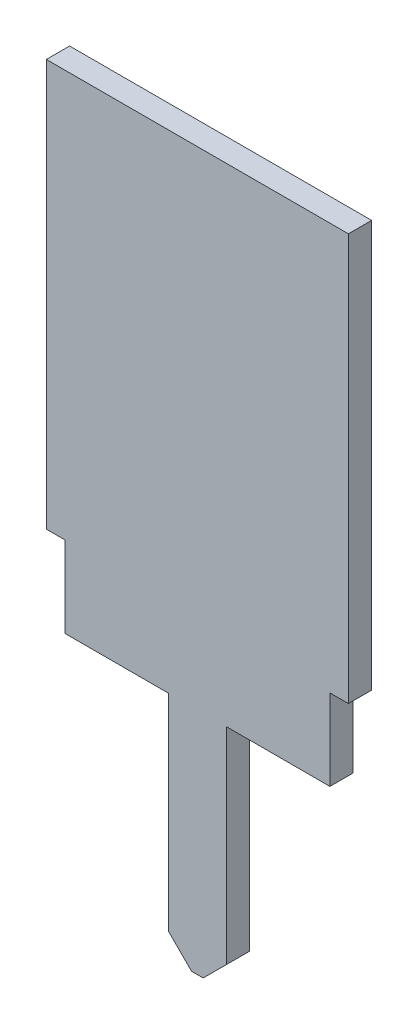
ISO-10303-21;
HEADER;
FILE_DESCRIPTION(('STEP AP214'),'2;1');
FILE_NAME('part.step','',(''),(''),'','','');
FILE_SCHEMA(('AUTOMOTIVE_DESIGN { 1 0 10303 214 1 1 1 1 }'));
ENDSEC;
DATA;
#1=APPLICATION_CONTEXT('core data for automotive mechanical design processes');
#2=APPLICATION_PROTOCOL_DEFINITION('international standard','automotive_design',2000,#1);
#3=PRODUCT_CONTEXT('',#1,'mechanical');
#4=PRODUCT('Part','Part','',(#3));
#5=PRODUCT_RELATED_PRODUCT_CATEGORY('part','',(#4));
#6=PRODUCT_DEFINITION_FORMATION('','',#4);
#7=PRODUCT_DEFINITION_CONTEXT('part definition',#1,'design');
#8=PRODUCT_DEFINITION('design','',#6,#7);
#9=PRODUCT_DEFINITION_SHAPE('','',#8);
#10=(LENGTH_UNIT() NAMED_UNIT(*) SI_UNIT(.MILLI.,.METRE.));
#11=(NAMED_UNIT(*) PLANE_ANGLE_UNIT() SI_UNIT($,.RADIAN.));
#12=(NAMED_UNIT(*) SI_UNIT($,.STERADIAN.) SOLID_ANGLE_UNIT());
#13=UNCERTAINTY_MEASURE_WITH_UNIT(LENGTH_MEASURE(1.E-05),#10,'distance_accuracy_value','');
#14=(GEOMETRIC_REPRESENTATION_CONTEXT(3) GLOBAL_UNCERTAINTY_ASSIGNED_CONTEXT((#13)) GLOBAL_UNIT_ASSIGNED_CONTEXT((#10,
#11,#12)) REPRESENTATION_CONTEXT('',''));
#15=CARTESIAN_POINT('',(0.,0.,0.));
#16=DIRECTION('',(0.,0.,1.));
#17=DIRECTION('',(1.,0.,0.));
#18=AXIS2_PLACEMENT_3D('',#15,#16,#17);
#19=CARTESIAN_POINT('',(1.65,0.,0.127));
#20=DIRECTION('',(0.,-1.,0.));
#21=DIRECTION('',(0.,0.,-1.));
#22=AXIS2_PLACEMENT_3D('',#19,#20,#21);
#23=PLANE('',#22);
#24=DIRECTION('',(-1.,0.,0.));
#25=VECTOR('',#24,1.);
#26=CARTESIAN_POINT('',(1.65,0.,-0.127));
#27=LINE('',#26,#25);
#28=CARTESIAN_POINT('',(1.65,0.,-0.127));
#29=VERTEX_POINT('',#28);
#30=CARTESIAN_POINT('',(-1.65,0.,-0.127));
#31=VERTEX_POINT('',#30);
#32=EDGE_CURVE('E11',#29,#31,#27,.T.);
#33=ORIENTED_EDGE('',*,*,#32,.T.);
#34=DIRECTION('',(0.,0.,-1.));
#35=VECTOR('',#34,1.);
#36=CARTESIAN_POINT('',(-1.65,0.,0.127));
#37=LINE('',#36,#35);
#38=CARTESIAN_POINT('',(-1.65,0.,0.127));
#39=VERTEX_POINT('',#38);
#40=EDGE_CURVE('E25',#39,#31,#37,.T.);
#41=ORIENTED_EDGE('',*,*,#40,.F.);
#42=DIRECTION('',(-1.,0.,0.));
#43=VECTOR('',#42,1.);
#44=CARTESIAN_POINT('',(1.65,0.,0.127));
#45=LINE('',#44,#43);
#46=CARTESIAN_POINT('',(1.65,0.,0.127));
#47=VERTEX_POINT('',#46);
#48=EDGE_CURVE('E296',#47,#39,#45,.T.);
#49=ORIENTED_EDGE('',*,*,#48,.F.);
#50=DIRECTION('',(0.,0.,-1.));
#51=VECTOR('',#50,1.);
#52=CARTESIAN_POINT('',(1.65,0.,0.127));
#53=LINE('',#52,#51);
#54=EDGE_CURVE('E292',#47,#29,#53,.T.);
#55=ORIENTED_EDGE('',*,*,#54,.T.);
#56=EDGE_LOOP('',(#33,#41,#49,#55));
#57=FACE_BOUND('',#56,.T.);
#58=ADVANCED_FACE('F17',(#57),#23,.F.);
#59=CARTESIAN_POINT('',(1.65,-4.445,0.127));
#60=DIRECTION('',(-1.,0.,0.));
#61=DIRECTION('',(0.,0.,1.));
#62=AXIS2_PLACEMENT_3D('',#59,#60,#61);
#63=PLANE('',#62);
#64=DIRECTION('',(0.,1.,0.));
#65=VECTOR('',#64,1.);
#66=CARTESIAN_POINT('',(1.65,-4.445,-0.127));
#67=LINE('',#66,#65);
#68=CARTESIAN_POINT('',(1.65,-4.445,-0.127));
#69=VERTEX_POINT('',#68);
#70=EDGE_CURVE('E287',#69,#29,#67,.T.);
#71=ORIENTED_EDGE('',*,*,#70,.T.);
#72=ORIENTED_EDGE('',*,*,#54,.F.);
#73=DIRECTION('',(0.,1.,0.));
#74=VECTOR('',#73,1.);
#75=CARTESIAN_POINT('',(1.65,-4.445,0.127));
#76=LINE('',#75,#74);
#77=CARTESIAN_POINT('',(1.65,-4.445,0.127));
#78=VERTEX_POINT('',#77);
#79=EDGE_CURVE('E282',#78,#47,#76,.T.);
#80=ORIENTED_EDGE('',*,*,#79,.F.);
#81=DIRECTION('',(0.,0.,-1.));
#82=VECTOR('',#81,1.);
#83=CARTESIAN_POINT('',(1.65,-4.445,0.127));
#84=LINE('',#83,#82);
#85=EDGE_CURVE('E278',#78,#69,#84,.T.);
#86=ORIENTED_EDGE('',*,*,#85,.T.);
#87=EDGE_LOOP('',(#71,#72,#80,#86));
#88=FACE_BOUND('',#87,.T.);
#89=ADVANCED_FACE('F309',(#88),#63,.F.);
#90=CARTESIAN_POINT('',(1.448,-4.445,0.127));
#91=DIRECTION('',(0.,1.,0.));
#92=DIRECTION('',(0.,0.,1.));
#93=AXIS2_PLACEMENT_3D('',#90,#91,#92);
#94=PLANE('',#93);
#95=DIRECTION('',(1.,0.,0.));
#96=VECTOR('',#95,1.);
#97=CARTESIAN_POINT('',(1.448,-4.445,-0.127));
#98=LINE('',#97,#96);
#99=CARTESIAN_POINT('',(1.448,-4.445,-0.127));
#100=VERTEX_POINT('',#99);
#101=EDGE_CURVE('E273',#100,#69,#98,.T.);
#102=ORIENTED_EDGE('',*,*,#101,.T.);
#103=ORIENTED_EDGE('',*,*,#85,.F.);
#104=DIRECTION('',(1.,0.,0.));
#105=VECTOR('',#104,1.);
#106=CARTESIAN_POINT('',(1.448,-4.445,0.127));
#107=LINE('',#106,#105);
#108=CARTESIAN_POINT('',(1.448,-4.445,0.127));
#109=VERTEX_POINT('',#108);
#110=EDGE_CURVE('E268',#109,#78,#107,.T.);
#111=ORIENTED_EDGE('',*,*,#110,.F.);
#112=DIRECTION('',(0.,0.,-1.));
#113=VECTOR('',#112,1.);
#114=CARTESIAN_POINT('',(1.448,-4.445,0.127));
#115=LINE('',#114,#113);
#116=EDGE_CURVE('E264',#109,#100,#115,.T.);
#117=ORIENTED_EDGE('',*,*,#116,.T.);
#118=EDGE_LOOP('',(#102,#103,#111,#117));
#119=FACE_BOUND('',#118,.T.);
#120=ADVANCED_FACE('F316',(#119),#94,.F.);
#121=CARTESIAN_POINT('',(1.448,-5.33,0.127));
#122=DIRECTION('',(-1.,0.,0.));
#123=DIRECTION('',(0.,0.,1.));
#124=AXIS2_PLACEMENT_3D('',#121,#122,#123);
#125=PLANE('',#124);
#126=DIRECTION('',(0.,1.,0.));
#127=VECTOR('',#126,1.);
#128=CARTESIAN_POINT('',(1.448,-5.33,-0.127));
#129=LINE('',#128,#127);
#130=CARTESIAN_POINT('',(1.448,-5.33,-0.127));
#131=VERTEX_POINT('',#130);
#132=EDGE_CURVE('E259',#131,#100,#129,.T.);
#133=ORIENTED_EDGE('',*,*,#132,.T.);
#134=ORIENTED_EDGE('',*,*,#116,.F.);
#135=DIRECTION('',(0.,1.,0.));
#136=VECTOR('',#135,1.);
#137=CARTESIAN_POINT('',(1.448,-5.33,0.127));
#138=LINE('',#137,#136);
#139=CARTESIAN_POINT('',(1.448,-5.33,0.127));
#140=VERTEX_POINT('',#139);
#141=EDGE_CURVE('E254',#140,#109,#138,.T.);
#142=ORIENTED_EDGE('',*,*,#141,.F.);
#143=DIRECTION('',(0.,0.,-1.));
#144=VECTOR('',#143,1.);
#145=CARTESIAN_POINT('',(1.448,-5.33,0.127));
#146=LINE('',#145,#144);
#147=EDGE_CURVE('E250',#140,#131,#146,.T.);
#148=ORIENTED_EDGE('',*,*,#147,.T.);
#149=EDGE_LOOP('',(#133,#134,#142,#148));
#150=FACE_BOUND('',#149,.T.);
#151=ADVANCED_FACE('F319',(#150),#125,.F.);
#152=CARTESIAN_POINT('',(0.3175,-5.33,0.127));
#153=DIRECTION('',(0.,1.,0.));
#154=DIRECTION('',(0.,0.,1.));
#155=AXIS2_PLACEMENT_3D('',#152,#153,#154);
#156=PLANE('',#155);
#157=DIRECTION('',(1.,0.,0.));
#158=VECTOR('',#157,1.);
#159=CARTESIAN_POINT('',(0.3175,-5.33,-0.127));
#160=LINE('',#159,#158);
#161=CARTESIAN_POINT('',(0.3175,-5.33,-0.127));
#162=VERTEX_POINT('',#161);
#163=EDGE_CURVE('E245',#162,#131,#160,.T.);
#164=ORIENTED_EDGE('',*,*,#163,.T.);
#165=ORIENTED_EDGE('',*,*,#147,.F.);
#166=DIRECTION('',(1.,0.,0.));
#167=VECTOR('',#166,1.);
#168=CARTESIAN_POINT('',(0.3175,-5.33,0.127));
#169=LINE('',#168,#167);
#170=CARTESIAN_POINT('',(0.3175,-5.33,0.127));
#171=VERTEX_POINT('',#170);
#172=EDGE_CURVE('E240',#171,#140,#169,.T.);
#173=ORIENTED_EDGE('',*,*,#172,.F.);
#174=DIRECTION('',(0.,0.,-1.));
#175=VECTOR('',#174,1.);
#176=CARTESIAN_POINT('',(0.3175,-5.33,0.127));
#177=LINE('',#176,#175);
#178=EDGE_CURVE('E236',#171,#162,#177,.T.);
#179=ORIENTED_EDGE('',*,*,#178,.T.);
#180=EDGE_LOOP('',(#164,#165,#173,#179));
#181=FACE_BOUND('',#180,.T.);
#182=ADVANCED_FACE('F322',(#181),#156,.F.);
#183=CARTESIAN_POINT('',(0.3175,-7.581,0.127));
#184=DIRECTION('',(-1.,0.,0.));
#185=DIRECTION('',(0.,0.,1.));
#186=AXIS2_PLACEMENT_3D('',#183,#184,#185);
#187=PLANE('',#186);
#188=DIRECTION('',(0.,1.,0.));
#189=VECTOR('',#188,1.);
#190=CARTESIAN_POINT('',(0.3175,-7.581,-0.127));
#191=LINE('',#190,#189);
#192=CARTESIAN_POINT('',(0.3175,-7.581,-0.127));
#193=VERTEX_POINT('',#192);
#194=EDGE_CURVE('E231',#193,#162,#191,.T.);
#195=ORIENTED_EDGE('',*,*,#194,.T.);
#196=ORIENTED_EDGE('',*,*,#178,.F.);
#197=DIRECTION('',(0.,1.,0.));
#198=VECTOR('',#197,1.);
#199=CARTESIAN_POINT('',(0.3175,-7.581,0.127));
#200=LINE('',#199,#198);
#201=CARTESIAN_POINT('',(0.3175,-7.581,0.127));
#202=VERTEX_POINT('',#201);
#203=EDGE_CURVE('E226',#202,#171,#200,.T.);
#204=ORIENTED_EDGE('',*,*,#203,.F.);
#205=DIRECTION('',(0.,0.,-1.));
#206=VECTOR('',#205,1.);
#207=CARTESIAN_POINT('',(0.3175,-7.581,0.127));
#208=LINE('',#207,#206);
#209=EDGE_CURVE('E222',#202,#193,#208,.T.);
#210=ORIENTED_EDGE('',*,*,#209,.T.);
#211=EDGE_LOOP('',(#195,#196,#204,#210));
#212=FACE_BOUND('',#211,.T.);
#213=ADVANCED_FACE('F328',(#212),#187,.F.);
#214=CARTESIAN_POINT('',(0.0635,-7.835,0.127));
#215=DIRECTION('',(-0.707106781186546,0.707106781186549,0.));
#216=DIRECTION('',(-0.707106781186549,-0.707106781186546,0.));
#217=AXIS2_PLACEMENT_3D('',#214,#215,#216);
#218=PLANE('',#217);
#219=DIRECTION('',(0.707106781186549,0.707106781186546,0.));
#220=VECTOR('',#219,1.);
#221=CARTESIAN_POINT('',(0.0635,-7.835,-0.127));
#222=LINE('',#221,#220);
#223=CARTESIAN_POINT('',(0.0635,-7.835,-0.127));
#224=VERTEX_POINT('',#223);
#225=EDGE_CURVE('E217',#224,#193,#222,.T.);
#226=ORIENTED_EDGE('',*,*,#225,.T.);
#227=ORIENTED_EDGE('',*,*,#209,.F.);
#228=DIRECTION('',(0.707106781186549,0.707106781186546,0.));
#229=VECTOR('',#228,1.);
#230=CARTESIAN_POINT('',(0.0635,-7.835,0.127));
#231=LINE('',#230,#229);
#232=CARTESIAN_POINT('',(0.0635,-7.835,0.127));
#233=VERTEX_POINT('',#232);
#234=EDGE_CURVE('E212',#233,#202,#231,.T.);
#235=ORIENTED_EDGE('',*,*,#234,.F.);
#236=DIRECTION('',(0.,0.,-1.));
#237=VECTOR('',#236,1.);
#238=CARTESIAN_POINT('',(0.0635,-7.835,0.127));
#239=LINE('',#238,#237);
#240=EDGE_CURVE('E208',#233,#224,#239,.T.);
#241=ORIENTED_EDGE('',*,*,#240,.T.);
#242=EDGE_LOOP('',(#226,#227,#235,#241));
#243=FACE_BOUND('',#242,.T.);
#244=ADVANCED_FACE('F331',(#243),#218,.F.);
#245=CARTESIAN_POINT('',(-0.0635,-7.835,0.127));
#246=DIRECTION('',(0.,1.,0.));
#247=DIRECTION('',(0.,0.,1.));
#248=AXIS2_PLACEMENT_3D('',#245,#246,#247);
#249=PLANE('',#248);
#250=DIRECTION('',(1.,0.,0.));
#251=VECTOR('',#250,1.);
#252=CARTESIAN_POINT('',(-0.0635,-7.835,-0.127));
#253=LINE('',#252,#251);
#254=CARTESIAN_POINT('',(-0.0635,-7.835,-0.127));
#255=VERTEX_POINT('',#254);
#256=EDGE_CURVE('E203',#255,#224,#253,.T.);
#257=ORIENTED_EDGE('',*,*,#256,.T.);
#258=ORIENTED_EDGE('',*,*,#240,.F.);
#259=DIRECTION('',(1.,0.,0.));
#260=VECTOR('',#259,1.);
#261=CARTESIAN_POINT('',(-0.0635,-7.835,0.127));
#262=LINE('',#261,#260);
#263=CARTESIAN_POINT('',(-0.0635,-7.835,0.127));
#264=VERTEX_POINT('',#263);
#265=EDGE_CURVE('E198',#264,#233,#262,.T.);
#266=ORIENTED_EDGE('',*,*,#265,.F.);
#267=DIRECTION('',(0.,0.,-1.));
#268=VECTOR('',#267,1.);
#269=CARTESIAN_POINT('',(-0.0635,-7.835,0.127));
#270=LINE('',#269,#268);
#271=EDGE_CURVE('E194',#264,#255,#270,.T.);
#272=ORIENTED_EDGE('',*,*,#271,.T.);
#273=EDGE_LOOP('',(#257,#258,#266,#272));
#274=FACE_BOUND('',#273,.T.);
#275=ADVANCED_FACE('F334',(#274),#249,.F.);
#276=CARTESIAN_POINT('',(-0.3175,-7.581,0.127));
#277=DIRECTION('',(0.707106781186546,0.707106781186549,0.));
#278=DIRECTION('',(-0.707106781186549,0.707106781186546,0.));
#279=AXIS2_PLACEMENT_3D('',#276,#277,#278);
#280=PLANE('',#279);
#281=DIRECTION('',(0.707106781186549,-0.707106781186546,0.));
#282=VECTOR('',#281,1.);
#283=CARTESIAN_POINT('',(-0.3175,-7.581,-0.127));
#284=LINE('',#283,#282);
#285=CARTESIAN_POINT('',(-0.3175,-7.581,-0.127));
#286=VERTEX_POINT('',#285);
#287=EDGE_CURVE('E189',#286,#255,#284,.T.);
#288=ORIENTED_EDGE('',*,*,#287,.T.);
#289=ORIENTED_EDGE('',*,*,#271,.F.);
#290=DIRECTION('',(0.707106781186549,-0.707106781186546,0.));
#291=VECTOR('',#290,1.);
#292=CARTESIAN_POINT('',(-0.3175,-7.581,0.127));
#293=LINE('',#292,#291);
#294=CARTESIAN_POINT('',(-0.3175,-7.581,0.127));
#295=VERTEX_POINT('',#294);
#296=EDGE_CURVE('E184',#295,#264,#293,.T.);
#297=ORIENTED_EDGE('',*,*,#296,.F.);
#298=DIRECTION('',(0.,0.,-1.));
#299=VECTOR('',#298,1.);
#300=CARTESIAN_POINT('',(-0.3175,-7.581,0.127));
#301=LINE('',#300,#299);
#302=EDGE_CURVE('E180',#295,#286,#301,.T.);
#303=ORIENTED_EDGE('',*,*,#302,.T.);
#304=EDGE_LOOP('',(#288,#289,#297,#303));
#305=FACE_BOUND('',#304,.T.);
#306=ADVANCED_FACE('F339',(#305),#280,.F.);
#307=CARTESIAN_POINT('',(-0.3175,-5.33,0.127));
#308=DIRECTION('',(1.,0.,0.));
#309=DIRECTION('',(0.,0.,-1.));
#310=AXIS2_PLACEMENT_3D('',#307,#308,#309);
#311=PLANE('',#310);
#312=DIRECTION('',(0.,-1.,0.));
#313=VECTOR('',#312,1.);
#314=CARTESIAN_POINT('',(-0.3175,-5.33,-0.127));
#315=LINE('',#314,#313);
#316=CARTESIAN_POINT('',(-0.3175,-5.33,-0.127));
#317=VERTEX_POINT('',#316);
#318=EDGE_CURVE('E175',#317,#286,#315,.T.);
#319=ORIENTED_EDGE('',*,*,#318,.T.);
#320=ORIENTED_EDGE('',*,*,#302,.F.);
#321=DIRECTION('',(0.,-1.,0.));
#322=VECTOR('',#321,1.);
#323=CARTESIAN_POINT('',(-0.3175,-5.33,0.127));
#324=LINE('',#323,#322);
#325=CARTESIAN_POINT('',(-0.3175,-5.33,0.127));
#326=VERTEX_POINT('',#325);
#327=EDGE_CURVE('E170',#326,#295,#324,.T.);
#328=ORIENTED_EDGE('',*,*,#327,.F.);
#329=DIRECTION('',(0.,0.,-1.));
#330=VECTOR('',#329,1.);
#331=CARTESIAN_POINT('',(-0.3175,-5.33,0.127));
#332=LINE('',#331,#330);
#333=EDGE_CURVE('E166',#326,#317,#332,.T.);
#334=ORIENTED_EDGE('',*,*,#333,.T.);
#335=EDGE_LOOP('',(#319,#320,#328,#334));
#336=FACE_BOUND('',#335,.T.);
#337=ADVANCED_FACE('F342',(#336),#311,.F.);
#338=CARTESIAN_POINT('',(-1.448,-5.33,0.127));
#339=DIRECTION('',(0.,1.,0.));
#340=DIRECTION('',(0.,0.,1.));
#341=AXIS2_PLACEMENT_3D('',#338,#339,#340);
#342=PLANE('',#341);
#343=DIRECTION('',(1.,0.,0.));
#344=VECTOR('',#343,1.);
#345=CARTESIAN_POINT('',(-1.448,-5.33,-0.127));
#346=LINE('',#345,#344);
#347=CARTESIAN_POINT('',(-1.448,-5.33,-0.127));
#348=VERTEX_POINT('',#347);
#349=EDGE_CURVE('E161',#348,#317,#346,.T.);
#350=ORIENTED_EDGE('',*,*,#349,.T.);
#351=ORIENTED_EDGE('',*,*,#333,.F.);
#352=DIRECTION('',(1.,0.,0.));
#353=VECTOR('',#352,1.);
#354=CARTESIAN_POINT('',(-1.448,-5.33,0.127));
#355=LINE('',#354,#353);
#356=CARTESIAN_POINT('',(-1.448,-5.33,0.127));
#357=VERTEX_POINT('',#356);
#358=EDGE_CURVE('E156',#357,#326,#355,.T.);
#359=ORIENTED_EDGE('',*,*,#358,.F.);
#360=DIRECTION('',(0.,0.,-1.));
#361=VECTOR('',#360,1.);
#362=CARTESIAN_POINT('',(-1.448,-5.33,0.127));
#363=LINE('',#362,#361);
#364=EDGE_CURVE('E152',#357,#348,#363,.T.);
#365=ORIENTED_EDGE('',*,*,#364,.T.);
#366=EDGE_LOOP('',(#350,#351,#359,#365));
#367=FACE_BOUND('',#366,.T.);
#368=ADVANCED_FACE('F345',(#367),#342,.F.);
#369=CARTESIAN_POINT('',(-1.448,-4.445,0.127));
#370=DIRECTION('',(1.,0.,0.));
#371=DIRECTION('',(0.,0.,-1.));
#372=AXIS2_PLACEMENT_3D('',#369,#370,#371);
#373=PLANE('',#372);
#374=DIRECTION('',(0.,-1.,0.));
#375=VECTOR('',#374,1.);
#376=CARTESIAN_POINT('',(-1.448,-4.445,-0.127));
#377=LINE('',#376,#375);
#378=CARTESIAN_POINT('',(-1.448,-4.445,-0.127));
#379=VERTEX_POINT('',#378);
#380=EDGE_CURVE('E134',#379,#348,#377,.T.);
#381=ORIENTED_EDGE('',*,*,#380,.T.);
#382=ORIENTED_EDGE('',*,*,#364,.F.);
#383=DIRECTION('',(0.,-1.,0.));
#384=VECTOR('',#383,1.);
#385=CARTESIAN_POINT('',(-1.448,-4.445,0.127));
#386=LINE('',#385,#384);
#387=CARTESIAN_POINT('',(-1.448,-4.445,0.127));
#388=VERTEX_POINT('',#387);
#389=EDGE_CURVE('E137',#388,#357,#386,.T.);
#390=ORIENTED_EDGE('',*,*,#389,.F.);
#391=DIRECTION('',(0.,0.,-1.));
#392=VECTOR('',#391,1.);
#393=CARTESIAN_POINT('',(-1.448,-4.445,0.127));
#394=LINE('',#393,#392);
#395=EDGE_CURVE('E135',#388,#379,#394,.T.);
#396=ORIENTED_EDGE('',*,*,#395,.T.);
#397=EDGE_LOOP('',(#381,#382,#390,#396));
#398=FACE_BOUND('',#397,.T.);
#399=ADVANCED_FACE('F348',(#398),#373,.F.);
#400=CARTESIAN_POINT('',(-1.65,-4.445,0.127));
#401=DIRECTION('',(0.,1.,0.));
#402=DIRECTION('',(0.,0.,1.));
#403=AXIS2_PLACEMENT_3D('',#400,#401,#402);
#404=PLANE('',#403);
#405=DIRECTION('',(1.,0.,0.));
#406=VECTOR('',#405,1.);
#407=CARTESIAN_POINT('',(-1.65,-4.445,-0.127));
#408=LINE('',#407,#406);
#409=CARTESIAN_POINT('',(-1.65,-4.445,-0.127));
#410=VERTEX_POINT('',#409);
#411=EDGE_CURVE('E118',#410,#379,#408,.T.);
#412=ORIENTED_EDGE('',*,*,#411,.T.);
#413=ORIENTED_EDGE('',*,*,#395,.F.);
#414=DIRECTION('',(1.,0.,0.));
#415=VECTOR('',#414,1.);
#416=CARTESIAN_POINT('',(-1.65,-4.445,0.127));
#417=LINE('',#416,#415);
#418=CARTESIAN_POINT('',(-1.65,-4.445,0.127));
#419=VERTEX_POINT('',#418);
#420=EDGE_CURVE('E121',#419,#388,#417,.T.);
#421=ORIENTED_EDGE('',*,*,#420,.F.);
#422=DIRECTION('',(0.,0.,-1.));
#423=VECTOR('',#422,1.);
#424=CARTESIAN_POINT('',(-1.65,-4.445,0.127));
#425=LINE('',#424,#423);
#426=EDGE_CURVE('E113',#419,#410,#425,.T.);
#427=ORIENTED_EDGE('',*,*,#426,.T.);
#428=EDGE_LOOP('',(#412,#413,#421,#427));
#429=FACE_BOUND('',#428,.T.);
#430=ADVANCED_FACE('F115',(#429),#404,.F.);
#431=CARTESIAN_POINT('',(-1.65,0.,0.127));
#432=DIRECTION('',(1.,0.,0.));
#433=DIRECTION('',(0.,0.,-1.));
#434=AXIS2_PLACEMENT_3D('',#431,#432,#433);
#435=PLANE('',#434);
#436=DIRECTION('',(0.,-1.,0.));
#437=VECTOR('',#436,1.);
#438=CARTESIAN_POINT('',(-1.65,0.,-0.127));
#439=LINE('',#438,#437);
#440=EDGE_CURVE('E124',#31,#410,#439,.T.);
#441=ORIENTED_EDGE('',*,*,#440,.T.);
#442=ORIENTED_EDGE('',*,*,#426,.F.);
#443=DIRECTION('',(0.,-1.,0.));
#444=VECTOR('',#443,1.);
#445=CARTESIAN_POINT('',(-1.65,0.,0.127));
#446=LINE('',#445,#444);
#447=EDGE_CURVE('E129',#39,#419,#446,.T.);
#448=ORIENTED_EDGE('',*,*,#447,.F.);
#449=ORIENTED_EDGE('',*,*,#40,.T.);
#450=EDGE_LOOP('',(#441,#442,#448,#449));
#451=FACE_BOUND('',#450,.T.);
#452=ADVANCED_FACE('F127',(#451),#435,.F.);
#453=CARTESIAN_POINT('',(0.,0.,0.127));
#454=DIRECTION('',(0.,0.,1.));
#455=DIRECTION('',(1.,0.,0.));
#456=AXIS2_PLACEMENT_3D('',#453,#454,#455);
#457=PLANE('',#456);
#458=ORIENTED_EDGE('',*,*,#447,.T.);
#459=ORIENTED_EDGE('',*,*,#420,.T.);
#460=ORIENTED_EDGE('',*,*,#389,.T.);
#461=ORIENTED_EDGE('',*,*,#358,.T.);
#462=ORIENTED_EDGE('',*,*,#327,.T.);
#463=ORIENTED_EDGE('',*,*,#296,.T.);
#464=ORIENTED_EDGE('',*,*,#265,.T.);
#465=ORIENTED_EDGE('',*,*,#234,.T.);
#466=ORIENTED_EDGE('',*,*,#203,.T.);
#467=ORIENTED_EDGE('',*,*,#172,.T.);
#468=ORIENTED_EDGE('',*,*,#141,.T.);
#469=ORIENTED_EDGE('',*,*,#110,.T.);
#470=ORIENTED_EDGE('',*,*,#79,.T.);
#471=ORIENTED_EDGE('',*,*,#48,.T.);
#472=EDGE_LOOP('',(#458,#459,#460,#461,#462,#463,#464,#465,#466,#467,#468,#469,#470,#471));
#473=FACE_BOUND('',#472,.T.);
#474=ADVANCED_FACE('F306',(#473),#457,.T.);
#475=CARTESIAN_POINT('',(0.,0.,-0.127));
#476=DIRECTION('',(0.,0.,1.));
#477=DIRECTION('',(1.,0.,0.));
#478=AXIS2_PLACEMENT_3D('',#475,#476,#477);
#479=PLANE('',#478);
#480=ORIENTED_EDGE('',*,*,#440,.F.);
#481=ORIENTED_EDGE('',*,*,#32,.F.);
#482=ORIENTED_EDGE('',*,*,#70,.F.);
#483=ORIENTED_EDGE('',*,*,#101,.F.);
#484=ORIENTED_EDGE('',*,*,#132,.F.);
#485=ORIENTED_EDGE('',*,*,#163,.F.);
#486=ORIENTED_EDGE('',*,*,#194,.F.);
#487=ORIENTED_EDGE('',*,*,#225,.F.);
#488=ORIENTED_EDGE('',*,*,#256,.F.);
#489=ORIENTED_EDGE('',*,*,#287,.F.);
#490=ORIENTED_EDGE('',*,*,#318,.F.);
#491=ORIENTED_EDGE('',*,*,#349,.F.);
#492=ORIENTED_EDGE('',*,*,#380,.F.);
#493=ORIENTED_EDGE('',*,*,#411,.F.);
#494=EDGE_LOOP('',(#480,#481,#482,#483,#484,#485,#486,#487,#488,#489,#490,#491,#492,#493));
#495=FACE_BOUND('',#494,.T.);
#496=ADVANCED_FACE('F131',(#495),#479,.F.);
#497=CLOSED_SHELL('',(#58,#89,#120,#151,#182,#213,#244,#275,#306,#337,#368,#399,#430,#452,#474,#496));
#498=MANIFOLD_SOLID_BREP('B1',#497);
#499=ADVANCED_BREP_SHAPE_REPRESENTATION('',(#18,#498),#14);
#500=SHAPE_DEFINITION_REPRESENTATION(#9,#499);
ENDSEC;
END-ISO-10303-21;
